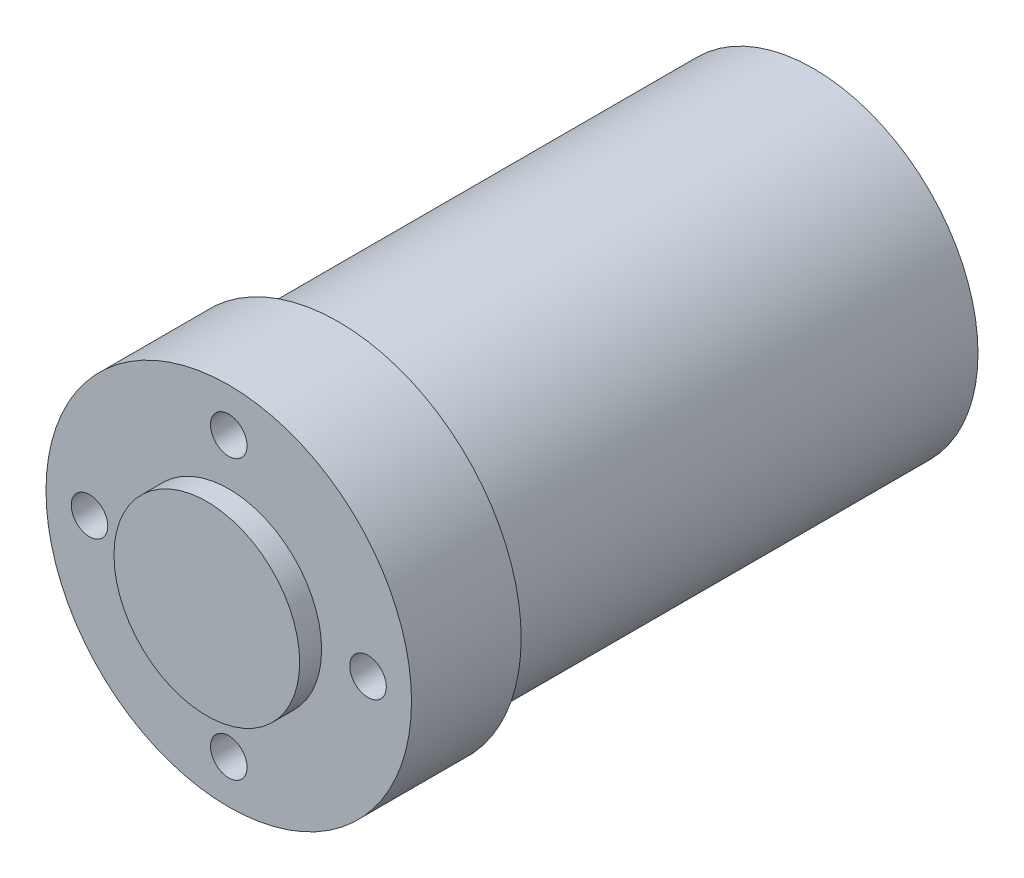
ISO-10303-21;
HEADER;
FILE_DESCRIPTION(('STEP AP214'),'2;1');
FILE_NAME('part.step','',(''),(''),'','','');
FILE_SCHEMA(('AUTOMOTIVE_DESIGN { 1 0 10303 214 1 1 1 1 }'));
ENDSEC;
DATA;
#1=APPLICATION_CONTEXT('core data for automotive mechanical design processes');
#2=APPLICATION_PROTOCOL_DEFINITION('international standard','automotive_design',2000,#1);
#3=PRODUCT_CONTEXT('',#1,'mechanical');
#4=PRODUCT('Part','Part','',(#3));
#5=PRODUCT_RELATED_PRODUCT_CATEGORY('part','',(#4));
#6=PRODUCT_DEFINITION_FORMATION('','',#4);
#7=PRODUCT_DEFINITION_CONTEXT('part definition',#1,'design');
#8=PRODUCT_DEFINITION('design','',#6,#7);
#9=PRODUCT_DEFINITION_SHAPE('','',#8);
#10=(LENGTH_UNIT() NAMED_UNIT(*) SI_UNIT(.MILLI.,.METRE.));
#11=(NAMED_UNIT(*) PLANE_ANGLE_UNIT() SI_UNIT($,.RADIAN.));
#12=(NAMED_UNIT(*) SI_UNIT($,.STERADIAN.) SOLID_ANGLE_UNIT());
#13=UNCERTAINTY_MEASURE_WITH_UNIT(LENGTH_MEASURE(1.E-05),#10,'distance_accuracy_value','');
#14=(GEOMETRIC_REPRESENTATION_CONTEXT(3) GLOBAL_UNCERTAINTY_ASSIGNED_CONTEXT((#13)) GLOBAL_UNIT_ASSIGNED_CONTEXT((#10,
#11,#12)) REPRESENTATION_CONTEXT('',''));
#15=CARTESIAN_POINT('',(0.,0.,0.));
#16=DIRECTION('',(0.,0.,1.));
#17=DIRECTION('',(1.,0.,0.));
#18=AXIS2_PLACEMENT_3D('',#15,#16,#17);
#19=CARTESIAN_POINT('',(0.,0.,80.));
#20=DIRECTION('',(0.,0.,-1.));
#21=DIRECTION('',(-1.,0.,0.));
#22=AXIS2_PLACEMENT_3D('',#19,#20,#21);
#23=CYLINDRICAL_SURFACE('',#22,25.);
#24=CARTESIAN_POINT('',(0.,0.,80.));
#25=DIRECTION('',(0.,0.,-1.));
#26=DIRECTION('',(-1.,0.,0.));
#27=AXIS2_PLACEMENT_3D('',#24,#25,#26);
#28=CIRCLE('',#27,25.);
#29=CARTESIAN_POINT('',(-25.,0.,80.));
#30=VERTEX_POINT('',#29);
#31=EDGE_CURVE('E10',#30,#30,#28,.T.);
#32=ORIENTED_EDGE('',*,*,#31,.T.);
#33=EDGE_LOOP('',(#32));
#34=FACE_BOUND('',#33,.T.);
#35=CARTESIAN_POINT('',(0.,0.,65.));
#36=DIRECTION('',(0.,0.,-1.));
#37=DIRECTION('',(-1.,0.,0.));
#38=AXIS2_PLACEMENT_3D('',#35,#36,#37);
#39=CIRCLE('',#38,25.);
#40=CARTESIAN_POINT('',(-25.,0.,65.));
#41=VERTEX_POINT('',#40);
#42=EDGE_CURVE('E45',#41,#41,#39,.T.);
#43=ORIENTED_EDGE('',*,*,#42,.F.);
#44=EDGE_LOOP('',(#43));
#45=FACE_BOUND('',#44,.T.);
#46=ADVANCED_FACE('F38',(#34,#45),#23,.T.);
#47=CARTESIAN_POINT('',(25.,0.,80.));
#48=DIRECTION('',(0.,0.,1.));
#49=DIRECTION('',(1.,0.,0.));
#50=AXIS2_PLACEMENT_3D('',#47,#48,#49);
#51=PLANE('',#50);
#52=CARTESIAN_POINT('',(-19.0499999999995,-5.41433564649196E-13,80.));
#53=DIRECTION('',(0.,0.,1.));
#54=DIRECTION('',(1.,0.,0.));
#55=AXIS2_PLACEMENT_3D('',#52,#53,#54);
#56=CIRCLE('',#55,2.50000000000086);
#57=CARTESIAN_POINT('',(-16.5499999999986,-5.41433564649196E-13,80.));
#58=VERTEX_POINT('',#57);
#59=EDGE_CURVE('E161',#58,#58,#56,.T.);
#60=ORIENTED_EDGE('',*,*,#59,.F.);
#61=EDGE_LOOP('',(#60));
#62=FACE_BOUND('',#61,.T.);
#63=CARTESIAN_POINT('',(1.07820122499364E-12,-19.05,80.));
#64=DIRECTION('',(0.,0.,1.));
#65=DIRECTION('',(1.,0.,0.));
#66=AXIS2_PLACEMENT_3D('',#63,#64,#65);
#67=CIRCLE('',#66,2.50000000000086);
#68=CARTESIAN_POINT('',(2.50000000000193,-19.05,80.));
#69=VERTEX_POINT('',#68);
#70=EDGE_CURVE('E154',#69,#69,#67,.T.);
#71=ORIENTED_EDGE('',*,*,#70,.F.);
#72=EDGE_LOOP('',(#71));
#73=FACE_BOUND('',#72,.T.);
#74=CARTESIAN_POINT('',(19.0500000000005,5.39100612496821E-13,80.));
#75=DIRECTION('',(0.,0.,1.));
#76=DIRECTION('',(1.,0.,0.));
#77=AXIS2_PLACEMENT_3D('',#74,#75,#76);
#78=CIRCLE('',#77,2.50000000000086);
#79=CARTESIAN_POINT('',(21.5500000000014,5.39100612496821E-13,80.));
#80=VERTEX_POINT('',#79);
#81=EDGE_CURVE('E146',#80,#80,#78,.T.);
#82=ORIENTED_EDGE('',*,*,#81,.F.);
#83=EDGE_LOOP('',(#82));
#84=FACE_BOUND('',#83,.T.);
#85=CARTESIAN_POINT('',(0.,19.05,80.));
#86=DIRECTION('',(0.,0.,1.));
#87=DIRECTION('',(1.,0.,0.));
#88=AXIS2_PLACEMENT_3D('',#85,#86,#87);
#89=CIRCLE('',#88,2.50000000000086);
#90=CARTESIAN_POINT('',(2.50000000000086,19.05,80.));
#91=VERTEX_POINT('',#90);
#92=EDGE_CURVE('E139',#91,#91,#89,.T.);
#93=ORIENTED_EDGE('',*,*,#92,.F.);
#94=EDGE_LOOP('',(#93));
#95=FACE_BOUND('',#94,.T.);
#96=CARTESIAN_POINT('',(0.,0.,80.));
#97=DIRECTION('',(0.,0.,1.));
#98=DIRECTION('',(1.,0.,0.));
#99=AXIS2_PLACEMENT_3D('',#96,#97,#98);
#100=CIRCLE('',#99,12.7);
#101=CARTESIAN_POINT('',(12.7,0.,80.));
#102=VERTEX_POINT('',#101);
#103=EDGE_CURVE('E57',#102,#102,#100,.T.);
#104=ORIENTED_EDGE('',*,*,#103,.F.);
#105=EDGE_LOOP('',(#104));
#106=FACE_BOUND('',#105,.T.);
#107=ORIENTED_EDGE('',*,*,#31,.F.);
#108=EDGE_LOOP('',(#107));
#109=FACE_BOUND('',#108,.T.);
#110=ADVANCED_FACE('F168',(#62,#73,#84,#95,#106,#109),#51,.T.);
#111=CARTESIAN_POINT('',(0.,0.,65.));
#112=DIRECTION('',(0.,0.,-1.));
#113=DIRECTION('',(-1.,0.,0.));
#114=AXIS2_PLACEMENT_3D('',#111,#112,#113);
#115=PLANE('',#114);
#116=CARTESIAN_POINT('',(0.,0.,65.));
#117=DIRECTION('',(0.,0.,-1.));
#118=DIRECTION('',(-1.,0.,0.));
#119=AXIS2_PLACEMENT_3D('',#116,#117,#118);
#120=CIRCLE('',#119,22.4917);
#121=CARTESIAN_POINT('',(-22.4917,0.,65.));
#122=VERTEX_POINT('',#121);
#123=EDGE_CURVE('E64',#122,#122,#120,.T.);
#124=ORIENTED_EDGE('',*,*,#123,.F.);
#125=EDGE_LOOP('',(#124));
#126=FACE_BOUND('',#125,.T.);
#127=ORIENTED_EDGE('',*,*,#42,.T.);
#128=EDGE_LOOP('',(#127));
#129=FACE_BOUND('',#128,.T.);
#130=ADVANCED_FACE('F171',(#126,#129),#115,.T.);
#131=CARTESIAN_POINT('',(0.,0.,83.));
#132=DIRECTION('',(0.,0.,-1.));
#133=DIRECTION('',(-1.,0.,0.));
#134=AXIS2_PLACEMENT_3D('',#131,#132,#133);
#135=CYLINDRICAL_SURFACE('',#134,12.7);
#136=CARTESIAN_POINT('',(0.,0.,83.));
#137=DIRECTION('',(0.,0.,1.));
#138=DIRECTION('',(1.,0.,0.));
#139=AXIS2_PLACEMENT_3D('',#136,#137,#138);
#140=CIRCLE('',#139,12.7);
#141=CARTESIAN_POINT('',(12.7,0.,83.));
#142=VERTEX_POINT('',#141);
#143=EDGE_CURVE('E51',#142,#142,#140,.T.);
#144=ORIENTED_EDGE('',*,*,#143,.F.);
#145=EDGE_LOOP('',(#144));
#146=FACE_BOUND('',#145,.T.);
#147=ORIENTED_EDGE('',*,*,#103,.T.);
#148=EDGE_LOOP('',(#147));
#149=FACE_BOUND('',#148,.T.);
#150=ADVANCED_FACE('F181',(#146,#149),#135,.T.);
#151=CARTESIAN_POINT('',(0.,0.,83.));
#152=DIRECTION('',(0.,0.,1.));
#153=DIRECTION('',(1.,0.,0.));
#154=AXIS2_PLACEMENT_3D('',#151,#152,#153);
#155=PLANE('',#154);
#156=ORIENTED_EDGE('',*,*,#143,.T.);
#157=EDGE_LOOP('',(#156));
#158=FACE_BOUND('',#157,.T.);
#159=ADVANCED_FACE('F183',(#158),#155,.T.);
#160=CARTESIAN_POINT('',(0.,0.,0.));
#161=DIRECTION('',(0.,0.,1.));
#162=DIRECTION('',(1.,0.,0.));
#163=AXIS2_PLACEMENT_3D('',#160,#161,#162);
#164=CYLINDRICAL_SURFACE('',#163,22.4917);
#165=CARTESIAN_POINT('',(0.,0.,0.));
#166=DIRECTION('',(0.,0.,-1.));
#167=DIRECTION('',(-1.,0.,0.));
#168=AXIS2_PLACEMENT_3D('',#165,#166,#167);
#169=CIRCLE('',#168,22.4917);
#170=CARTESIAN_POINT('',(-22.4917,0.,0.));
#171=VERTEX_POINT('',#170);
#172=EDGE_CURVE('E62',#171,#171,#169,.T.);
#173=ORIENTED_EDGE('',*,*,#172,.F.);
#174=EDGE_LOOP('',(#173));
#175=FACE_BOUND('',#174,.T.);
#176=ORIENTED_EDGE('',*,*,#123,.T.);
#177=EDGE_LOOP('',(#176));
#178=FACE_BOUND('',#177,.T.);
#179=ADVANCED_FACE('F190',(#175,#178),#164,.T.);
#180=CARTESIAN_POINT('',(0.,0.,0.));
#181=DIRECTION('',(0.,0.,-1.));
#182=DIRECTION('',(-1.,0.,0.));
#183=AXIS2_PLACEMENT_3D('',#180,#181,#182);
#184=PLANE('',#183);
#185=CARTESIAN_POINT('',(12.3743686707641,12.3743686707635,0.));
#186=DIRECTION('',(0.,0.,-1.));
#187=DIRECTION('',(-1.,0.,0.));
#188=AXIS2_PLACEMENT_3D('',#185,#186,#187);
#189=CIRCLE('',#188,2.49999999999999);
#190=CARTESIAN_POINT('',(9.87436867076416,12.3743686707635,0.));
#191=VERTEX_POINT('',#190);
#192=EDGE_CURVE('E131',#191,#191,#189,.T.);
#193=ORIENTED_EDGE('',*,*,#192,.F.);
#194=EDGE_LOOP('',(#193));
#195=FACE_BOUND('',#194,.T.);
#196=CARTESIAN_POINT('',(17.4999999999985,-1.49213974509621E-12,0.));
#197=DIRECTION('',(0.,0.,-1.));
#198=DIRECTION('',(-1.,0.,0.));
#199=AXIS2_PLACEMENT_3D('',#196,#197,#198);
#200=CIRCLE('',#199,2.49999999999999);
#201=CARTESIAN_POINT('',(14.9999999999985,-1.49213974509621E-12,0.));
#202=VERTEX_POINT('',#201);
#203=EDGE_CURVE('E123',#202,#202,#200,.T.);
#204=ORIENTED_EDGE('',*,*,#203,.F.);
#205=EDGE_LOOP('',(#204));
#206=FACE_BOUND('',#205,.T.);
#207=CARTESIAN_POINT('',(12.374368670762,-12.3743686707656,0.));
#208=DIRECTION('',(0.,0.,-1.));
#209=DIRECTION('',(-1.,0.,0.));
#210=AXIS2_PLACEMENT_3D('',#207,#208,#209);
#211=CIRCLE('',#210,2.49999999999999);
#212=CARTESIAN_POINT('',(9.87436867076205,-12.3743686707656,0.));
#213=VERTEX_POINT('',#212);
#214=EDGE_CURVE('E115',#213,#213,#211,.T.);
#215=ORIENTED_EDGE('',*,*,#214,.F.);
#216=EDGE_LOOP('',(#215));
#217=FACE_BOUND('',#216,.T.);
#218=CARTESIAN_POINT('',(-2.97999322639541E-12,-17.5,0.));
#219=DIRECTION('',(0.,0.,-1.));
#220=DIRECTION('',(-1.,0.,0.));
#221=AXIS2_PLACEMENT_3D('',#218,#219,#220);
#222=CIRCLE('',#221,2.49999999999999);
#223=CARTESIAN_POINT('',(-2.50000000000297,-17.5,0.));
#224=VERTEX_POINT('',#223);
#225=EDGE_CURVE('E107',#224,#224,#222,.T.);
#226=ORIENTED_EDGE('',*,*,#225,.F.);
#227=EDGE_LOOP('',(#226));
#228=FACE_BOUND('',#227,.T.);
#229=CARTESIAN_POINT('',(-12.3743686707671,-12.3743686707635,0.));
#230=DIRECTION('',(0.,0.,-1.));
#231=DIRECTION('',(-1.,0.,0.));
#232=AXIS2_PLACEMENT_3D('',#229,#230,#231);
#233=CIRCLE('',#232,2.49999999999999);
#234=CARTESIAN_POINT('',(-14.8743686707671,-12.3743686707635,0.));
#235=VERTEX_POINT('',#234);
#236=EDGE_CURVE('E99',#235,#235,#233,.T.);
#237=ORIENTED_EDGE('',*,*,#236,.F.);
#238=EDGE_LOOP('',(#237));
#239=FACE_BOUND('',#238,.T.);
#240=CARTESIAN_POINT('',(-17.5000000000015,1.4899966131977E-12,0.));
#241=DIRECTION('',(0.,0.,-1.));
#242=DIRECTION('',(-1.,0.,0.));
#243=AXIS2_PLACEMENT_3D('',#240,#241,#242);
#244=CIRCLE('',#243,2.49999999999999);
#245=CARTESIAN_POINT('',(-20.0000000000015,1.4899966131977E-12,0.));
#246=VERTEX_POINT('',#245);
#247=EDGE_CURVE('E91',#246,#246,#244,.T.);
#248=ORIENTED_EDGE('',*,*,#247,.F.);
#249=EDGE_LOOP('',(#248));
#250=FACE_BOUND('',#249,.T.);
#251=CARTESIAN_POINT('',(-12.374368670765,12.3743686707656,0.));
#252=DIRECTION('',(0.,0.,-1.));
#253=DIRECTION('',(-1.,0.,0.));
#254=AXIS2_PLACEMENT_3D('',#251,#252,#253);
#255=CIRCLE('',#254,2.49999999999999);
#256=CARTESIAN_POINT('',(-14.874368670765,12.3743686707656,0.));
#257=VERTEX_POINT('',#256);
#258=EDGE_CURVE('E83',#257,#257,#255,.T.);
#259=ORIENTED_EDGE('',*,*,#258,.F.);
#260=EDGE_LOOP('',(#259));
#261=FACE_BOUND('',#260,.T.);
#262=CARTESIAN_POINT('',(0.,17.5,0.));
#263=DIRECTION('',(0.,0.,-1.));
#264=DIRECTION('',(-1.,0.,0.));
#265=AXIS2_PLACEMENT_3D('',#262,#263,#264);
#266=CIRCLE('',#265,2.49999999999999);
#267=CARTESIAN_POINT('',(-2.49999999999999,17.5,0.));
#268=VERTEX_POINT('',#267);
#269=EDGE_CURVE('E75',#268,#268,#266,.T.);
#270=ORIENTED_EDGE('',*,*,#269,.F.);
#271=EDGE_LOOP('',(#270));
#272=FACE_BOUND('',#271,.T.);
#273=ORIENTED_EDGE('',*,*,#172,.T.);
#274=EDGE_LOOP('',(#273));
#275=FACE_BOUND('',#274,.T.);
#276=ADVANCED_FACE('F221',(#195,#206,#217,#228,#239,#250,#261,#272,#275),#184,.T.);
#277=CARTESIAN_POINT('',(0.,17.5,7.99999999999999));
#278=DIRECTION('',(0.,0.,1.));
#279=DIRECTION('',(1.,0.,0.));
#280=AXIS2_PLACEMENT_3D('',#277,#278,#279);
#281=PLANE('',#280);
#282=CARTESIAN_POINT('',(0.,17.5,7.99999999999999));
#283=DIRECTION('',(0.,0.,-1.));
#284=DIRECTION('',(-1.,0.,0.));
#285=AXIS2_PLACEMENT_3D('',#282,#283,#284);
#286=CIRCLE('',#285,2.49999999999999);
#287=CARTESIAN_POINT('',(-2.49999999999999,17.5,7.99999999999999));
#288=VERTEX_POINT('',#287);
#289=EDGE_CURVE('E68',#288,#288,#286,.T.);
#290=ORIENTED_EDGE('',*,*,#289,.T.);
#291=EDGE_LOOP('',(#290));
#292=FACE_BOUND('',#291,.T.);
#293=ADVANCED_FACE('F230',(#292),#281,.F.);
#294=CARTESIAN_POINT('',(0.,17.5,0.));
#295=DIRECTION('',(0.,0.,-1.));
#296=DIRECTION('',(-1.,0.,0.));
#297=AXIS2_PLACEMENT_3D('',#294,#295,#296);
#298=CYLINDRICAL_SURFACE('',#297,2.49999999999999);
#299=ORIENTED_EDGE('',*,*,#289,.F.);
#300=EDGE_LOOP('',(#299));
#301=FACE_BOUND('',#300,.T.);
#302=ORIENTED_EDGE('',*,*,#269,.T.);
#303=EDGE_LOOP('',(#302));
#304=FACE_BOUND('',#303,.T.);
#305=ADVANCED_FACE('F239',(#301,#304),#298,.F.);
#306=CARTESIAN_POINT('',(-12.374368670765,12.3743686707656,7.99999999999999));
#307=DIRECTION('',(0.,0.,1.));
#308=DIRECTION('',(1.,0.,0.));
#309=AXIS2_PLACEMENT_3D('',#306,#307,#308);
#310=PLANE('',#309);
#311=CARTESIAN_POINT('',(-12.374368670765,12.3743686707656,7.99999999999999));
#312=DIRECTION('',(0.,0.,-1.));
#313=DIRECTION('',(-1.,0.,0.));
#314=AXIS2_PLACEMENT_3D('',#311,#312,#313);
#315=CIRCLE('',#314,2.49999999999999);
#316=CARTESIAN_POINT('',(-14.874368670765,12.3743686707656,7.99999999999999));
#317=VERTEX_POINT('',#316);
#318=EDGE_CURVE('E79',#317,#317,#315,.T.);
#319=ORIENTED_EDGE('',*,*,#318,.T.);
#320=EDGE_LOOP('',(#319));
#321=FACE_BOUND('',#320,.T.);
#322=ADVANCED_FACE('F248',(#321),#310,.F.);
#323=CARTESIAN_POINT('',(-12.374368670765,12.3743686707656,0.));
#324=DIRECTION('',(0.,0.,-1.));
#325=DIRECTION('',(-1.,0.,0.));
#326=AXIS2_PLACEMENT_3D('',#323,#324,#325);
#327=CYLINDRICAL_SURFACE('',#326,2.49999999999999);
#328=ORIENTED_EDGE('',*,*,#318,.F.);
#329=EDGE_LOOP('',(#328));
#330=FACE_BOUND('',#329,.T.);
#331=ORIENTED_EDGE('',*,*,#258,.T.);
#332=EDGE_LOOP('',(#331));
#333=FACE_BOUND('',#332,.T.);
#334=ADVANCED_FACE('F257',(#330,#333),#327,.F.);
#335=CARTESIAN_POINT('',(-17.5000000000015,1.4899966131977E-12,7.99999999999999));
#336=DIRECTION('',(0.,0.,1.));
#337=DIRECTION('',(1.,0.,0.));
#338=AXIS2_PLACEMENT_3D('',#335,#336,#337);
#339=PLANE('',#338);
#340=CARTESIAN_POINT('',(-17.5000000000015,1.4899966131977E-12,7.99999999999999));
#341=DIRECTION('',(0.,0.,-1.));
#342=DIRECTION('',(-1.,0.,0.));
#343=AXIS2_PLACEMENT_3D('',#340,#341,#342);
#344=CIRCLE('',#343,2.49999999999999);
#345=CARTESIAN_POINT('',(-20.0000000000015,1.4899966131977E-12,7.99999999999999));
#346=VERTEX_POINT('',#345);
#347=EDGE_CURVE('E87',#346,#346,#344,.T.);
#348=ORIENTED_EDGE('',*,*,#347,.T.);
#349=EDGE_LOOP('',(#348));
#350=FACE_BOUND('',#349,.T.);
#351=ADVANCED_FACE('F266',(#350),#339,.F.);
#352=CARTESIAN_POINT('',(-17.5000000000015,1.4899966131977E-12,0.));
#353=DIRECTION('',(0.,0.,-1.));
#354=DIRECTION('',(-1.,0.,0.));
#355=AXIS2_PLACEMENT_3D('',#352,#353,#354);
#356=CYLINDRICAL_SURFACE('',#355,2.49999999999999);
#357=ORIENTED_EDGE('',*,*,#347,.F.);
#358=EDGE_LOOP('',(#357));
#359=FACE_BOUND('',#358,.T.);
#360=ORIENTED_EDGE('',*,*,#247,.T.);
#361=EDGE_LOOP('',(#360));
#362=FACE_BOUND('',#361,.T.);
#363=ADVANCED_FACE('F275',(#359,#362),#356,.F.);
#364=CARTESIAN_POINT('',(-12.3743686707671,-12.3743686707635,7.99999999999999));
#365=DIRECTION('',(0.,0.,1.));
#366=DIRECTION('',(1.,0.,0.));
#367=AXIS2_PLACEMENT_3D('',#364,#365,#366);
#368=PLANE('',#367);
#369=CARTESIAN_POINT('',(-12.3743686707671,-12.3743686707635,7.99999999999999));
#370=DIRECTION('',(0.,0.,-1.));
#371=DIRECTION('',(-1.,0.,0.));
#372=AXIS2_PLACEMENT_3D('',#369,#370,#371);
#373=CIRCLE('',#372,2.49999999999999);
#374=CARTESIAN_POINT('',(-14.8743686707671,-12.3743686707635,7.99999999999999));
#375=VERTEX_POINT('',#374);
#376=EDGE_CURVE('E95',#375,#375,#373,.T.);
#377=ORIENTED_EDGE('',*,*,#376,.T.);
#378=EDGE_LOOP('',(#377));
#379=FACE_BOUND('',#378,.T.);
#380=ADVANCED_FACE('F284',(#379),#368,.F.);
#381=CARTESIAN_POINT('',(-12.3743686707671,-12.3743686707635,0.));
#382=DIRECTION('',(0.,0.,-1.));
#383=DIRECTION('',(-1.,0.,0.));
#384=AXIS2_PLACEMENT_3D('',#381,#382,#383);
#385=CYLINDRICAL_SURFACE('',#384,2.49999999999999);
#386=ORIENTED_EDGE('',*,*,#376,.F.);
#387=EDGE_LOOP('',(#386));
#388=FACE_BOUND('',#387,.T.);
#389=ORIENTED_EDGE('',*,*,#236,.T.);
#390=EDGE_LOOP('',(#389));
#391=FACE_BOUND('',#390,.T.);
#392=ADVANCED_FACE('F293',(#388,#391),#385,.F.);
#393=CARTESIAN_POINT('',(-2.98195266127404E-12,-17.5,7.99999999999999));
#394=DIRECTION('',(0.,0.,1.));
#395=DIRECTION('',(1.,0.,0.));
#396=AXIS2_PLACEMENT_3D('',#393,#394,#395);
#397=PLANE('',#396);
#398=CARTESIAN_POINT('',(-2.97999322639541E-12,-17.5,7.99999999999999));
#399=DIRECTION('',(0.,0.,-1.));
#400=DIRECTION('',(-1.,0.,0.));
#401=AXIS2_PLACEMENT_3D('',#398,#399,#400);
#402=CIRCLE('',#401,2.49999999999999);
#403=CARTESIAN_POINT('',(-2.50000000000297,-17.5,7.99999999999999));
#404=VERTEX_POINT('',#403);
#405=EDGE_CURVE('E103',#404,#404,#402,.T.);
#406=ORIENTED_EDGE('',*,*,#405,.T.);
#407=EDGE_LOOP('',(#406));
#408=FACE_BOUND('',#407,.T.);
#409=ADVANCED_FACE('F302',(#408),#397,.F.);
#410=CARTESIAN_POINT('',(-2.97999322639541E-12,-17.5,0.));
#411=DIRECTION('',(0.,0.,-1.));
#412=DIRECTION('',(-1.,0.,0.));
#413=AXIS2_PLACEMENT_3D('',#410,#411,#412);
#414=CYLINDRICAL_SURFACE('',#413,2.49999999999999);
#415=ORIENTED_EDGE('',*,*,#405,.F.);
#416=EDGE_LOOP('',(#415));
#417=FACE_BOUND('',#416,.T.);
#418=ORIENTED_EDGE('',*,*,#225,.T.);
#419=EDGE_LOOP('',(#418));
#420=FACE_BOUND('',#419,.T.);
#421=ADVANCED_FACE('F311',(#417,#420),#414,.F.);
#422=CARTESIAN_POINT('',(12.374368670762,-12.3743686707656,7.99999999999999));
#423=DIRECTION('',(0.,0.,1.));
#424=DIRECTION('',(1.,0.,0.));
#425=AXIS2_PLACEMENT_3D('',#422,#423,#424);
#426=PLANE('',#425);
#427=CARTESIAN_POINT('',(12.374368670762,-12.3743686707656,7.99999999999999));
#428=DIRECTION('',(0.,0.,-1.));
#429=DIRECTION('',(-1.,0.,0.));
#430=AXIS2_PLACEMENT_3D('',#427,#428,#429);
#431=CIRCLE('',#430,2.49999999999999);
#432=CARTESIAN_POINT('',(9.87436867076205,-12.3743686707656,7.99999999999999));
#433=VERTEX_POINT('',#432);
#434=EDGE_CURVE('E111',#433,#433,#431,.T.);
#435=ORIENTED_EDGE('',*,*,#434,.T.);
#436=EDGE_LOOP('',(#435));
#437=FACE_BOUND('',#436,.T.);
#438=ADVANCED_FACE('F320',(#437),#426,.F.);
#439=CARTESIAN_POINT('',(12.374368670762,-12.3743686707656,0.));
#440=DIRECTION('',(0.,0.,-1.));
#441=DIRECTION('',(-1.,0.,0.));
#442=AXIS2_PLACEMENT_3D('',#439,#440,#441);
#443=CYLINDRICAL_SURFACE('',#442,2.49999999999999);
#444=ORIENTED_EDGE('',*,*,#434,.F.);
#445=EDGE_LOOP('',(#444));
#446=FACE_BOUND('',#445,.T.);
#447=ORIENTED_EDGE('',*,*,#214,.T.);
#448=EDGE_LOOP('',(#447));
#449=FACE_BOUND('',#448,.T.);
#450=ADVANCED_FACE('F329',(#446,#449),#443,.F.);
#451=CARTESIAN_POINT('',(17.4999999999985,-1.49213974509621E-12,7.99999999999999));
#452=DIRECTION('',(0.,0.,1.));
#453=DIRECTION('',(1.,0.,0.));
#454=AXIS2_PLACEMENT_3D('',#451,#452,#453);
#455=PLANE('',#454);
#456=CARTESIAN_POINT('',(17.4999999999985,-1.49213974509621E-12,7.99999999999999));
#457=DIRECTION('',(0.,0.,-1.));
#458=DIRECTION('',(-1.,0.,0.));
#459=AXIS2_PLACEMENT_3D('',#456,#457,#458);
#460=CIRCLE('',#459,2.49999999999999);
#461=CARTESIAN_POINT('',(14.9999999999985,-1.49213974509621E-12,7.99999999999999));
#462=VERTEX_POINT('',#461);
#463=EDGE_CURVE('E119',#462,#462,#460,.T.);
#464=ORIENTED_EDGE('',*,*,#463,.T.);
#465=EDGE_LOOP('',(#464));
#466=FACE_BOUND('',#465,.T.);
#467=ADVANCED_FACE('F338',(#466),#455,.F.);
#468=CARTESIAN_POINT('',(17.4999999999985,-1.49213974509621E-12,0.));
#469=DIRECTION('',(0.,0.,-1.));
#470=DIRECTION('',(-1.,0.,0.));
#471=AXIS2_PLACEMENT_3D('',#468,#469,#470);
#472=CYLINDRICAL_SURFACE('',#471,2.49999999999999);
#473=ORIENTED_EDGE('',*,*,#463,.F.);
#474=EDGE_LOOP('',(#473));
#475=FACE_BOUND('',#474,.T.);
#476=ORIENTED_EDGE('',*,*,#203,.T.);
#477=EDGE_LOOP('',(#476));
#478=FACE_BOUND('',#477,.T.);
#479=ADVANCED_FACE('F347',(#475,#478),#472,.F.);
#480=CARTESIAN_POINT('',(12.3743686707641,12.3743686707635,7.99999999999999));
#481=DIRECTION('',(0.,0.,1.));
#482=DIRECTION('',(1.,0.,0.));
#483=AXIS2_PLACEMENT_3D('',#480,#481,#482);
#484=PLANE('',#483);
#485=CARTESIAN_POINT('',(12.3743686707641,12.3743686707635,7.99999999999999));
#486=DIRECTION('',(0.,0.,-1.));
#487=DIRECTION('',(-1.,0.,0.));
#488=AXIS2_PLACEMENT_3D('',#485,#486,#487);
#489=CIRCLE('',#488,2.49999999999999);
#490=CARTESIAN_POINT('',(9.87436867076416,12.3743686707635,7.99999999999999));
#491=VERTEX_POINT('',#490);
#492=EDGE_CURVE('E127',#491,#491,#489,.T.);
#493=ORIENTED_EDGE('',*,*,#492,.T.);
#494=EDGE_LOOP('',(#493));
#495=FACE_BOUND('',#494,.T.);
#496=ADVANCED_FACE('F356',(#495),#484,.F.);
#497=CARTESIAN_POINT('',(12.3743686707641,12.3743686707635,0.));
#498=DIRECTION('',(0.,0.,-1.));
#499=DIRECTION('',(-1.,0.,0.));
#500=AXIS2_PLACEMENT_3D('',#497,#498,#499);
#501=CYLINDRICAL_SURFACE('',#500,2.49999999999999);
#502=ORIENTED_EDGE('',*,*,#492,.F.);
#503=EDGE_LOOP('',(#502));
#504=FACE_BOUND('',#503,.T.);
#505=ORIENTED_EDGE('',*,*,#192,.T.);
#506=EDGE_LOOP('',(#505));
#507=FACE_BOUND('',#506,.T.);
#508=ADVANCED_FACE('F365',(#504,#507),#501,.F.);
#509=CARTESIAN_POINT('',(0.,19.05,67.554));
#510=DIRECTION('',(0.,0.,-1.));
#511=DIRECTION('',(-1.,0.,0.));
#512=AXIS2_PLACEMENT_3D('',#509,#510,#511);
#513=PLANE('',#512);
#514=CARTESIAN_POINT('',(0.,19.05,67.554));
#515=DIRECTION('',(0.,0.,1.));
#516=DIRECTION('',(1.,0.,0.));
#517=AXIS2_PLACEMENT_3D('',#514,#515,#516);
#518=CIRCLE('',#517,2.50000000000085);
#519=CARTESIAN_POINT('',(2.50000000000085,19.05,67.554));
#520=VERTEX_POINT('',#519);
#521=EDGE_CURVE('E135',#520,#520,#518,.T.);
#522=ORIENTED_EDGE('',*,*,#521,.T.);
#523=EDGE_LOOP('',(#522));
#524=FACE_BOUND('',#523,.T.);
#525=ADVANCED_FACE('F374',(#524),#513,.F.);
#526=CARTESIAN_POINT('',(0.,19.05,80.));
#527=DIRECTION('',(0.,0.,1.));
#528=DIRECTION('',(1.,0.,0.));
#529=AXIS2_PLACEMENT_3D('',#526,#527,#528);
#530=CYLINDRICAL_SURFACE('',#529,2.50000000000085);
#531=ORIENTED_EDGE('',*,*,#521,.F.);
#532=EDGE_LOOP('',(#531));
#533=FACE_BOUND('',#532,.T.);
#534=ORIENTED_EDGE('',*,*,#92,.T.);
#535=EDGE_LOOP('',(#534));
#536=FACE_BOUND('',#535,.T.);
#537=ADVANCED_FACE('F383',(#533,#536),#530,.F.);
#538=CARTESIAN_POINT('',(19.0500000000005,5.39100612496821E-13,67.554));
#539=DIRECTION('',(0.,0.,-1.));
#540=DIRECTION('',(-1.,0.,0.));
#541=AXIS2_PLACEMENT_3D('',#538,#539,#540);
#542=PLANE('',#541);
#543=CARTESIAN_POINT('',(19.0500000000005,5.39100612496821E-13,67.554));
#544=DIRECTION('',(0.,0.,1.));
#545=DIRECTION('',(1.,0.,0.));
#546=AXIS2_PLACEMENT_3D('',#543,#544,#545);
#547=CIRCLE('',#546,2.50000000000086);
#548=CARTESIAN_POINT('',(21.5500000000014,5.39100612496821E-13,67.554));
#549=VERTEX_POINT('',#548);
#550=EDGE_CURVE('E143',#549,#549,#547,.T.);
#551=ORIENTED_EDGE('',*,*,#550,.T.);
#552=EDGE_LOOP('',(#551));
#553=FACE_BOUND('',#552,.T.);
#554=ADVANCED_FACE('F392',(#553),#542,.F.);
#555=CARTESIAN_POINT('',(19.0500000000005,5.39100612496821E-13,80.));
#556=DIRECTION('',(0.,0.,1.));
#557=DIRECTION('',(1.,0.,0.));
#558=AXIS2_PLACEMENT_3D('',#555,#556,#557);
#559=CYLINDRICAL_SURFACE('',#558,2.50000000000086);
#560=ORIENTED_EDGE('',*,*,#550,.F.);
#561=EDGE_LOOP('',(#560));
#562=FACE_BOUND('',#561,.T.);
#563=ORIENTED_EDGE('',*,*,#81,.T.);
#564=EDGE_LOOP('',(#563));
#565=FACE_BOUND('',#564,.T.);
#566=ADVANCED_FACE('F401',(#562,#565),#559,.F.);
#567=CARTESIAN_POINT('',(1.0751528341812E-12,-19.05,67.554));
#568=DIRECTION('',(0.,0.,-1.));
#569=DIRECTION('',(-1.,0.,0.));
#570=AXIS2_PLACEMENT_3D('',#567,#568,#569);
#571=PLANE('',#570);
#572=CARTESIAN_POINT('',(1.07820122499364E-12,-19.05,67.554));
#573=DIRECTION('',(0.,0.,1.));
#574=DIRECTION('',(1.,0.,0.));
#575=AXIS2_PLACEMENT_3D('',#572,#573,#574);
#576=CIRCLE('',#575,2.50000000000085);
#577=CARTESIAN_POINT('',(2.50000000000193,-19.05,67.554));
#578=VERTEX_POINT('',#577);
#579=EDGE_CURVE('E150',#578,#578,#576,.T.);
#580=ORIENTED_EDGE('',*,*,#579,.T.);
#581=EDGE_LOOP('',(#580));
#582=FACE_BOUND('',#581,.T.);
#583=ADVANCED_FACE('F410',(#582),#571,.F.);
#584=CARTESIAN_POINT('',(1.07820122499364E-12,-19.05,80.));
#585=DIRECTION('',(0.,0.,1.));
#586=DIRECTION('',(1.,0.,0.));
#587=AXIS2_PLACEMENT_3D('',#584,#585,#586);
#588=CYLINDRICAL_SURFACE('',#587,2.50000000000085);
#589=ORIENTED_EDGE('',*,*,#579,.F.);
#590=EDGE_LOOP('',(#589));
#591=FACE_BOUND('',#590,.T.);
#592=ORIENTED_EDGE('',*,*,#70,.T.);
#593=EDGE_LOOP('',(#592));
#594=FACE_BOUND('',#593,.T.);
#595=ADVANCED_FACE('F419',(#591,#594),#588,.F.);
#596=CARTESIAN_POINT('',(-19.0499999999995,-5.41433564649196E-13,67.554));
#597=DIRECTION('',(0.,0.,-1.));
#598=DIRECTION('',(-1.,0.,0.));
#599=AXIS2_PLACEMENT_3D('',#596,#597,#598);
#600=PLANE('',#599);
#601=CARTESIAN_POINT('',(-19.0499999999995,-5.41433564649196E-13,67.554));
#602=DIRECTION('',(0.,0.,1.));
#603=DIRECTION('',(1.,0.,0.));
#604=AXIS2_PLACEMENT_3D('',#601,#602,#603);
#605=CIRCLE('',#604,2.50000000000086);
#606=CARTESIAN_POINT('',(-16.5499999999986,-5.41433564649196E-13,67.554));
#607=VERTEX_POINT('',#606);
#608=EDGE_CURVE('E158',#607,#607,#605,.T.);
#609=ORIENTED_EDGE('',*,*,#608,.T.);
#610=EDGE_LOOP('',(#609));
#611=FACE_BOUND('',#610,.T.);
#612=ADVANCED_FACE('F428',(#611),#600,.F.);
#613=CARTESIAN_POINT('',(-19.0499999999995,-5.41433564649196E-13,80.));
#614=DIRECTION('',(0.,0.,1.));
#615=DIRECTION('',(1.,0.,0.));
#616=AXIS2_PLACEMENT_3D('',#613,#614,#615);
#617=CYLINDRICAL_SURFACE('',#616,2.50000000000086);
#618=ORIENTED_EDGE('',*,*,#608,.F.);
#619=EDGE_LOOP('',(#618));
#620=FACE_BOUND('',#619,.T.);
#621=ORIENTED_EDGE('',*,*,#59,.T.);
#622=EDGE_LOOP('',(#621));
#623=FACE_BOUND('',#622,.T.);
#624=ADVANCED_FACE('F166',(#620,#623),#617,.F.);
#625=CLOSED_SHELL('',(#46,#110,#130,#150,#159,#179,#276,#293,#305,#322,#334,#351,#363,#380,#392,
#409,#421,#438,#450,#467,#479,#496,#508,#525,#537,#554,#566,#583,#595,#612,#624));
#626=MANIFOLD_SOLID_BREP('B2',#625);
#627=ADVANCED_BREP_SHAPE_REPRESENTATION('',(#18,#626),#14);
#628=SHAPE_DEFINITION_REPRESENTATION(#9,#627);
ENDSEC;
END-ISO-10303-21;
